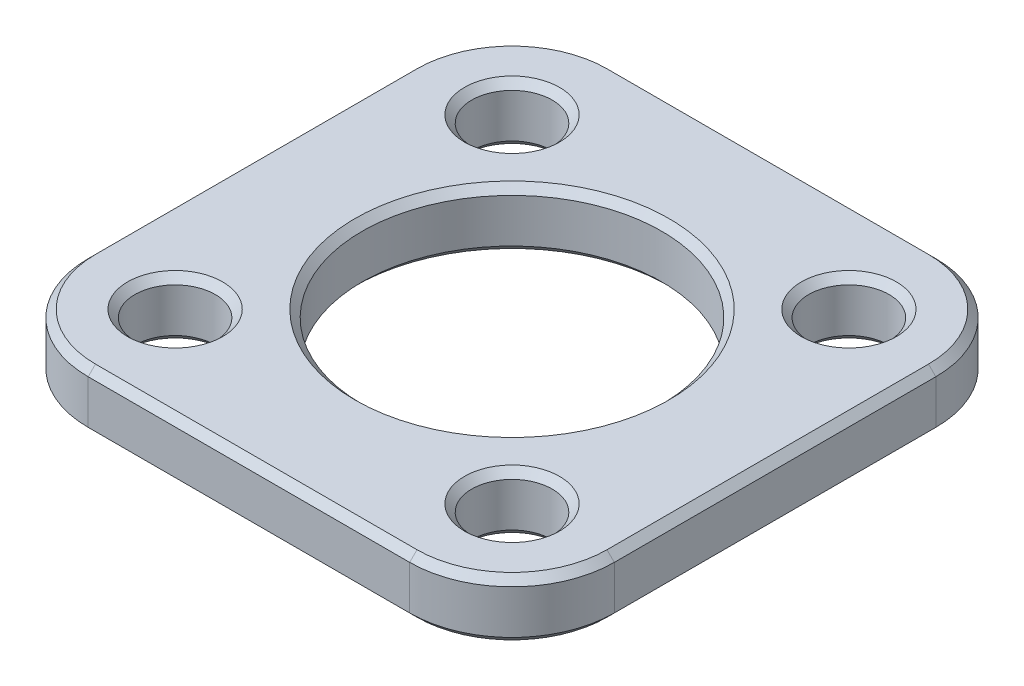
ISO-10303-21;
HEADER;
FILE_DESCRIPTION(('STEP AP214'),'2;1');
FILE_NAME('part.step','',(''),(''),'','','');
FILE_SCHEMA(('AUTOMOTIVE_DESIGN { 1 0 10303 214 1 1 1 1 }'));
ENDSEC;
DATA;
#1=APPLICATION_CONTEXT('core data for automotive mechanical design processes');
#2=APPLICATION_PROTOCOL_DEFINITION('international standard','automotive_design',2000,#1);
#3=PRODUCT_CONTEXT('',#1,'mechanical');
#4=PRODUCT('Part','Part','',(#3));
#5=PRODUCT_RELATED_PRODUCT_CATEGORY('part','',(#4));
#6=PRODUCT_DEFINITION_FORMATION('','',#4);
#7=PRODUCT_DEFINITION_CONTEXT('part definition',#1,'design');
#8=PRODUCT_DEFINITION('design','',#6,#7);
#9=PRODUCT_DEFINITION_SHAPE('','',#8);
#10=(LENGTH_UNIT() NAMED_UNIT(*) SI_UNIT(.MILLI.,.METRE.));
#11=(NAMED_UNIT(*) PLANE_ANGLE_UNIT() SI_UNIT($,.RADIAN.));
#12=(NAMED_UNIT(*) SI_UNIT($,.STERADIAN.) SOLID_ANGLE_UNIT());
#13=UNCERTAINTY_MEASURE_WITH_UNIT(LENGTH_MEASURE(1.E-05),#10,'distance_accuracy_value','');
#14=(GEOMETRIC_REPRESENTATION_CONTEXT(3) GLOBAL_UNCERTAINTY_ASSIGNED_CONTEXT((#13)) GLOBAL_UNIT_ASSIGNED_CONTEXT((#10,
#11,#12)) REPRESENTATION_CONTEXT('',''));
#15=CARTESIAN_POINT('',(0.,0.,0.));
#16=DIRECTION('',(0.,0.,1.));
#17=DIRECTION('',(1.,0.,0.));
#18=AXIS2_PLACEMENT_3D('',#15,#16,#17);
#19=CARTESIAN_POINT('',(-11.,4.,11.));
#20=DIRECTION('',(0.,1.,0.));
#21=DIRECTION('',(0.,0.,1.));
#22=AXIS2_PLACEMENT_3D('',#19,#20,#21);
#23=PLANE('',#22);
#24=CARTESIAN_POINT('',(-11.5258405333407,4.,11.5258405333407));
#25=DIRECTION('',(0.,1.,0.));
#26=DIRECTION('',(0.,0.,1.));
#27=AXIS2_PLACEMENT_3D('',#24,#25,#26);
#28=CIRCLE('',#27,3.25);
#29=CARTESIAN_POINT('',(-11.5258405333407,4.,14.7758405333407));
#30=VERTEX_POINT('',#29);
#31=EDGE_CURVE('E11',#30,#30,#28,.F.);
#32=ORIENTED_EDGE('',*,*,#31,.T.);
#33=EDGE_LOOP('',(#32));
#34=FACE_BOUND('',#33,.T.);
#35=CARTESIAN_POINT('',(11.5258405333407,4.,-11.5258405333407));
#36=DIRECTION('',(0.,1.,0.));
#37=DIRECTION('',(0.,0.,1.));
#38=AXIS2_PLACEMENT_3D('',#35,#36,#37);
#39=CIRCLE('',#38,3.25);
#40=CARTESIAN_POINT('',(11.5258405333407,4.,-8.27584053334073));
#41=VERTEX_POINT('',#40);
#42=EDGE_CURVE('E46',#41,#41,#39,.F.);
#43=ORIENTED_EDGE('',*,*,#42,.T.);
#44=EDGE_LOOP('',(#43));
#45=FACE_BOUND('',#44,.T.);
#46=CARTESIAN_POINT('',(0.,4.,0.));
#47=DIRECTION('',(0.,1.,0.));
#48=DIRECTION('',(0.,0.,1.));
#49=AXIS2_PLACEMENT_3D('',#46,#47,#48);
#50=CIRCLE('',#49,10.75);
#51=CARTESIAN_POINT('',(0.,4.,10.75));
#52=VERTEX_POINT('',#51);
#53=EDGE_CURVE('E281',#52,#52,#50,.F.);
#54=ORIENTED_EDGE('',*,*,#53,.T.);
#55=EDGE_LOOP('',(#54));
#56=FACE_BOUND('',#55,.T.);
#57=CARTESIAN_POINT('',(-11.,4.,-11.));
#58=DIRECTION('',(0.,1.,0.));
#59=DIRECTION('',(0.,0.,1.));
#60=AXIS2_PLACEMENT_3D('',#57,#58,#59);
#61=CIRCLE('',#60,6.50000000000001);
#62=CARTESIAN_POINT('',(-11.,4.,-17.5));
#63=VERTEX_POINT('',#62);
#64=CARTESIAN_POINT('',(-17.5,4.,-10.9999999999999));
#65=VERTEX_POINT('',#64);
#66=EDGE_CURVE('E54',#63,#65,#61,.T.);
#67=ORIENTED_EDGE('',*,*,#66,.T.);
#68=DIRECTION('',(0.,0.,1.));
#69=VECTOR('',#68,1.);
#70=CARTESIAN_POINT('',(-17.5,4.,10.9999999999999));
#71=LINE('',#70,#69);
#72=CARTESIAN_POINT('',(-17.5,4.,10.9999999999999));
#73=VERTEX_POINT('',#72);
#74=EDGE_CURVE('E279',#65,#73,#71,.T.);
#75=ORIENTED_EDGE('',*,*,#74,.T.);
#76=CARTESIAN_POINT('',(-11.,4.,11.));
#77=DIRECTION('',(0.,1.,0.));
#78=DIRECTION('',(0.,0.,1.));
#79=AXIS2_PLACEMENT_3D('',#76,#77,#78);
#80=CIRCLE('',#79,6.50000000000001);
#81=CARTESIAN_POINT('',(-10.9999999999999,4.,17.5));
#82=VERTEX_POINT('',#81);
#83=EDGE_CURVE('E267',#73,#82,#80,.T.);
#84=ORIENTED_EDGE('',*,*,#83,.T.);
#85=DIRECTION('',(1.,0.,0.));
#86=VECTOR('',#85,1.);
#87=CARTESIAN_POINT('',(11.,4.,17.5));
#88=LINE('',#87,#86);
#89=CARTESIAN_POINT('',(11.,4.,17.5));
#90=VERTEX_POINT('',#89);
#91=EDGE_CURVE('E269',#82,#90,#88,.T.);
#92=ORIENTED_EDGE('',*,*,#91,.T.);
#93=CARTESIAN_POINT('',(11.,4.,11.));
#94=DIRECTION('',(0.,1.,0.));
#95=DIRECTION('',(0.,0.,1.));
#96=AXIS2_PLACEMENT_3D('',#93,#94,#95);
#97=CIRCLE('',#96,6.50000000000001);
#98=CARTESIAN_POINT('',(17.5,4.,10.9999999999999));
#99=VERTEX_POINT('',#98);
#100=EDGE_CURVE('E271',#90,#99,#97,.T.);
#101=ORIENTED_EDGE('',*,*,#100,.T.);
#102=DIRECTION('',(0.,0.,-1.));
#103=VECTOR('',#102,1.);
#104=CARTESIAN_POINT('',(17.5,4.,-11.));
#105=LINE('',#104,#103);
#106=CARTESIAN_POINT('',(17.5,4.,-11.));
#107=VERTEX_POINT('',#106);
#108=EDGE_CURVE('E273',#99,#107,#105,.T.);
#109=ORIENTED_EDGE('',*,*,#108,.T.);
#110=CARTESIAN_POINT('',(11.,4.,-11.));
#111=DIRECTION('',(0.,1.,0.));
#112=DIRECTION('',(0.,0.,1.));
#113=AXIS2_PLACEMENT_3D('',#110,#111,#112);
#114=CIRCLE('',#113,6.50000000000001);
#115=CARTESIAN_POINT('',(11.,4.,-17.5));
#116=VERTEX_POINT('',#115);
#117=EDGE_CURVE('E275',#107,#116,#114,.T.);
#118=ORIENTED_EDGE('',*,*,#117,.T.);
#119=DIRECTION('',(-1.,0.,0.));
#120=VECTOR('',#119,1.);
#121=CARTESIAN_POINT('',(-10.9999999999999,4.,-17.5));
#122=LINE('',#121,#120);
#123=EDGE_CURVE('E59',#116,#63,#122,.T.);
#124=ORIENTED_EDGE('',*,*,#123,.T.);
#125=EDGE_LOOP('',(#67,#75,#84,#92,#101,#109,#118,#124));
#126=FACE_BOUND('',#125,.T.);
#127=CARTESIAN_POINT('',(-11.5258405333407,4.,-11.5258405333407));
#128=DIRECTION('',(0.,1.,0.));
#129=DIRECTION('',(0.,0.,1.));
#130=AXIS2_PLACEMENT_3D('',#127,#128,#129);
#131=CIRCLE('',#130,3.25);
#132=CARTESIAN_POINT('',(-11.5258405333407,4.,-8.27584053334073));
#133=VERTEX_POINT('',#132);
#134=EDGE_CURVE('E264',#133,#133,#131,.F.);
#135=ORIENTED_EDGE('',*,*,#134,.T.);
#136=EDGE_LOOP('',(#135));
#137=FACE_BOUND('',#136,.T.);
#138=CARTESIAN_POINT('',(11.5258405333407,4.,11.5258405333407));
#139=DIRECTION('',(0.,1.,0.));
#140=DIRECTION('',(0.,0.,1.));
#141=AXIS2_PLACEMENT_3D('',#138,#139,#140);
#142=CIRCLE('',#141,3.25);
#143=CARTESIAN_POINT('',(11.5258405333407,4.,14.7758405333407));
#144=VERTEX_POINT('',#143);
#145=EDGE_CURVE('E261',#144,#144,#142,.F.);
#146=ORIENTED_EDGE('',*,*,#145,.T.);
#147=EDGE_LOOP('',(#146));
#148=FACE_BOUND('',#147,.T.);
#149=ADVANCED_FACE('F36',(#34,#45,#56,#126,#137,#148),#23,.T.);
#150=CARTESIAN_POINT('',(-11.,0.,11.));
#151=DIRECTION('',(0.,1.,0.));
#152=DIRECTION('',(0.,0.,1.));
#153=AXIS2_PLACEMENT_3D('',#150,#151,#152);
#154=PLANE('',#153);
#155=CARTESIAN_POINT('',(-11.5258405333407,0.,11.5258405333407));
#156=DIRECTION('',(0.,1.,0.));
#157=DIRECTION('',(0.,0.,1.));
#158=AXIS2_PLACEMENT_3D('',#155,#156,#157);
#159=CIRCLE('',#158,3.24999999999999);
#160=CARTESIAN_POINT('',(-11.5258405333407,0.,14.7758405333407));
#161=VERTEX_POINT('',#160);
#162=EDGE_CURVE('E196',#161,#161,#159,.T.);
#163=ORIENTED_EDGE('',*,*,#162,.T.);
#164=EDGE_LOOP('',(#163));
#165=FACE_BOUND('',#164,.T.);
#166=CARTESIAN_POINT('',(11.5258405333407,0.,11.5258405333407));
#167=DIRECTION('',(0.,1.,0.));
#168=DIRECTION('',(0.,0.,1.));
#169=AXIS2_PLACEMENT_3D('',#166,#167,#168);
#170=CIRCLE('',#169,3.24999999999999);
#171=CARTESIAN_POINT('',(11.5258405333407,0.,14.7758405333407));
#172=VERTEX_POINT('',#171);
#173=EDGE_CURVE('E193',#172,#172,#170,.T.);
#174=ORIENTED_EDGE('',*,*,#173,.T.);
#175=EDGE_LOOP('',(#174));
#176=FACE_BOUND('',#175,.T.);
#177=CARTESIAN_POINT('',(11.5258405333407,0.,-11.5258405333407));
#178=DIRECTION('',(0.,1.,0.));
#179=DIRECTION('',(0.,0.,1.));
#180=AXIS2_PLACEMENT_3D('',#177,#178,#179);
#181=CIRCLE('',#180,3.25);
#182=CARTESIAN_POINT('',(11.5258405333407,0.,-8.27584053334073));
#183=VERTEX_POINT('',#182);
#184=EDGE_CURVE('E190',#183,#183,#181,.T.);
#185=ORIENTED_EDGE('',*,*,#184,.T.);
#186=EDGE_LOOP('',(#185));
#187=FACE_BOUND('',#186,.T.);
#188=CARTESIAN_POINT('',(-11.5258405333407,0.,-11.5258405333407));
#189=DIRECTION('',(0.,1.,0.));
#190=DIRECTION('',(0.,0.,1.));
#191=AXIS2_PLACEMENT_3D('',#188,#189,#190);
#192=CIRCLE('',#191,3.25);
#193=CARTESIAN_POINT('',(-11.5258405333407,0.,-8.27584053334073));
#194=VERTEX_POINT('',#193);
#195=EDGE_CURVE('E182',#194,#194,#192,.T.);
#196=ORIENTED_EDGE('',*,*,#195,.T.);
#197=EDGE_LOOP('',(#196));
#198=FACE_BOUND('',#197,.T.);
#199=CARTESIAN_POINT('',(0.,0.,0.));
#200=DIRECTION('',(0.,1.,0.));
#201=DIRECTION('',(0.,0.,1.));
#202=AXIS2_PLACEMENT_3D('',#199,#200,#201);
#203=CIRCLE('',#202,10.75);
#204=CARTESIAN_POINT('',(0.,0.,10.75));
#205=VERTEX_POINT('',#204);
#206=EDGE_CURVE('E179',#205,#205,#203,.T.);
#207=ORIENTED_EDGE('',*,*,#206,.T.);
#208=EDGE_LOOP('',(#207));
#209=FACE_BOUND('',#208,.T.);
#210=CARTESIAN_POINT('',(11.,0.,11.));
#211=DIRECTION('',(0.,1.,0.));
#212=DIRECTION('',(0.,0.,1.));
#213=AXIS2_PLACEMENT_3D('',#210,#211,#212);
#214=CIRCLE('',#213,6.5);
#215=CARTESIAN_POINT('',(17.5,0.,11.));
#216=VERTEX_POINT('',#215);
#217=CARTESIAN_POINT('',(11.,0.,17.5));
#218=VERTEX_POINT('',#217);
#219=EDGE_CURVE('E178',#216,#218,#214,.F.);
#220=ORIENTED_EDGE('',*,*,#219,.T.);
#221=DIRECTION('',(-1.,0.,0.));
#222=VECTOR('',#221,1.);
#223=CARTESIAN_POINT('',(-11.,0.,17.5));
#224=LINE('',#223,#222);
#225=CARTESIAN_POINT('',(-10.9999999999999,0.,17.5));
#226=VERTEX_POINT('',#225);
#227=EDGE_CURVE('E157',#218,#226,#224,.T.);
#228=ORIENTED_EDGE('',*,*,#227,.T.);
#229=CARTESIAN_POINT('',(-11.,0.,11.));
#230=DIRECTION('',(0.,1.,0.));
#231=DIRECTION('',(0.,0.,1.));
#232=AXIS2_PLACEMENT_3D('',#229,#230,#231);
#233=CIRCLE('',#232,6.5);
#234=CARTESIAN_POINT('',(-17.5,0.,10.9999999999999));
#235=VERTEX_POINT('',#234);
#236=EDGE_CURVE('E167',#226,#235,#233,.F.);
#237=ORIENTED_EDGE('',*,*,#236,.T.);
#238=DIRECTION('',(0.,0.,-1.));
#239=VECTOR('',#238,1.);
#240=CARTESIAN_POINT('',(-17.5,0.,11.));
#241=LINE('',#240,#239);
#242=CARTESIAN_POINT('',(-17.5,0.,-11.));
#243=VERTEX_POINT('',#242);
#244=EDGE_CURVE('E173',#235,#243,#241,.T.);
#245=ORIENTED_EDGE('',*,*,#244,.T.);
#246=CARTESIAN_POINT('',(-11.,0.,-11.));
#247=DIRECTION('',(0.,1.,0.));
#248=DIRECTION('',(0.,0.,1.));
#249=AXIS2_PLACEMENT_3D('',#246,#247,#248);
#250=CIRCLE('',#249,6.5);
#251=CARTESIAN_POINT('',(-10.9999999999999,0.,-17.5));
#252=VERTEX_POINT('',#251);
#253=EDGE_CURVE('E359',#243,#252,#250,.F.);
#254=ORIENTED_EDGE('',*,*,#253,.T.);
#255=DIRECTION('',(1.,0.,0.));
#256=VECTOR('',#255,1.);
#257=CARTESIAN_POINT('',(-11.,0.,-17.5));
#258=LINE('',#257,#256);
#259=CARTESIAN_POINT('',(11.,0.,-17.5));
#260=VERTEX_POINT('',#259);
#261=EDGE_CURVE('E361',#252,#260,#258,.T.);
#262=ORIENTED_EDGE('',*,*,#261,.T.);
#263=CARTESIAN_POINT('',(11.,0.,-11.));
#264=DIRECTION('',(0.,1.,0.));
#265=DIRECTION('',(0.,0.,1.));
#266=AXIS2_PLACEMENT_3D('',#263,#264,#265);
#267=CIRCLE('',#266,6.5);
#268=CARTESIAN_POINT('',(17.5,0.,-11.));
#269=VERTEX_POINT('',#268);
#270=EDGE_CURVE('E363',#260,#269,#267,.F.);
#271=ORIENTED_EDGE('',*,*,#270,.T.);
#272=DIRECTION('',(0.,0.,1.));
#273=VECTOR('',#272,1.);
#274=CARTESIAN_POINT('',(17.5,0.,11.));
#275=LINE('',#274,#273);
#276=EDGE_CURVE('E184',#269,#216,#275,.T.);
#277=ORIENTED_EDGE('',*,*,#276,.T.);
#278=EDGE_LOOP('',(#220,#228,#237,#245,#254,#262,#271,#277));
#279=FACE_BOUND('',#278,.T.);
#280=ADVANCED_FACE('F176',(#165,#176,#187,#198,#209,#279),#154,.F.);
#281=CARTESIAN_POINT('',(-11.,4.,11.));
#282=DIRECTION('',(0.,-1.,0.));
#283=DIRECTION('',(0.,0.,-1.));
#284=AXIS2_PLACEMENT_3D('',#281,#282,#283);
#285=CYLINDRICAL_SURFACE('',#284,7.);
#286=DIRECTION('',(0.,-1.,0.));
#287=VECTOR('',#286,1.);
#288=CARTESIAN_POINT('',(-18.,4.,10.9999999999999));
#289=LINE('',#288,#287);
#290=CARTESIAN_POINT('',(-18.,3.50000000000002,10.9999999999999));
#291=VERTEX_POINT('',#290);
#292=CARTESIAN_POINT('',(-18.,0.499999999999997,10.9999999999999));
#293=VERTEX_POINT('',#292);
#294=EDGE_CURVE('E302',#291,#293,#289,.T.);
#295=ORIENTED_EDGE('',*,*,#294,.T.);
#296=CARTESIAN_POINT('',(-11.,0.499999999999997,11.));
#297=DIRECTION('',(0.,1.,0.));
#298=DIRECTION('',(0.,0.,1.));
#299=AXIS2_PLACEMENT_3D('',#296,#297,#298);
#300=CIRCLE('',#299,7.);
#301=CARTESIAN_POINT('',(-10.9999999999999,0.499999999999997,18.));
#302=VERTEX_POINT('',#301);
#303=EDGE_CURVE('E259',#293,#302,#300,.T.);
#304=ORIENTED_EDGE('',*,*,#303,.T.);
#305=DIRECTION('',(0.,-1.,0.));
#306=VECTOR('',#305,1.);
#307=CARTESIAN_POINT('',(-10.9999999999999,4.,18.));
#308=LINE('',#307,#306);
#309=CARTESIAN_POINT('',(-10.9999999999999,3.50000000000002,18.));
#310=VERTEX_POINT('',#309);
#311=EDGE_CURVE('E174',#310,#302,#308,.T.);
#312=ORIENTED_EDGE('',*,*,#311,.F.);
#313=CARTESIAN_POINT('',(-11.,3.50000000000002,11.));
#314=DIRECTION('',(0.,1.,0.));
#315=DIRECTION('',(0.,0.,1.));
#316=AXIS2_PLACEMENT_3D('',#313,#314,#315);
#317=CIRCLE('',#316,7.);
#318=EDGE_CURVE('E257',#310,#291,#317,.F.);
#319=ORIENTED_EDGE('',*,*,#318,.T.);
#320=EDGE_LOOP('',(#295,#304,#312,#319));
#321=FACE_BOUND('',#320,.T.);
#322=ADVANCED_FACE('F380',(#321),#285,.T.);
#323=CARTESIAN_POINT('',(-10.9999999999999,4.,18.));
#324=DIRECTION('',(0.,0.,-1.));
#325=DIRECTION('',(-1.,0.,0.));
#326=AXIS2_PLACEMENT_3D('',#323,#324,#325);
#327=PLANE('',#326);
#328=ORIENTED_EDGE('',*,*,#311,.T.);
#329=DIRECTION('',(1.,0.,0.));
#330=VECTOR('',#329,1.);
#331=CARTESIAN_POINT('',(-10.9999999999999,0.499999999999997,18.));
#332=LINE('',#331,#330);
#333=CARTESIAN_POINT('',(11.,0.499999999999997,18.));
#334=VERTEX_POINT('',#333);
#335=EDGE_CURVE('E160',#302,#334,#332,.T.);
#336=ORIENTED_EDGE('',*,*,#335,.T.);
#337=DIRECTION('',(0.,-1.,0.));
#338=VECTOR('',#337,1.);
#339=CARTESIAN_POINT('',(11.,4.,18.));
#340=LINE('',#339,#338);
#341=CARTESIAN_POINT('',(11.,3.50000000000002,18.));
#342=VERTEX_POINT('',#341);
#343=EDGE_CURVE('E349',#342,#334,#340,.T.);
#344=ORIENTED_EDGE('',*,*,#343,.F.);
#345=DIRECTION('',(-1.,0.,0.));
#346=VECTOR('',#345,1.);
#347=CARTESIAN_POINT('',(-10.9999999999999,3.50000000000002,18.));
#348=LINE('',#347,#346);
#349=EDGE_CURVE('E229',#342,#310,#348,.T.);
#350=ORIENTED_EDGE('',*,*,#349,.T.);
#351=EDGE_LOOP('',(#328,#336,#344,#350));
#352=FACE_BOUND('',#351,.T.);
#353=ADVANCED_FACE('F373',(#352),#327,.F.);
#354=CARTESIAN_POINT('',(11.,4.,11.));
#355=DIRECTION('',(0.,-1.,0.));
#356=DIRECTION('',(0.,0.,-1.));
#357=AXIS2_PLACEMENT_3D('',#354,#355,#356);
#358=CYLINDRICAL_SURFACE('',#357,7.);
#359=ORIENTED_EDGE('',*,*,#343,.T.);
#360=CARTESIAN_POINT('',(11.,0.499999999999997,11.));
#361=DIRECTION('',(0.,1.,0.));
#362=DIRECTION('',(0.,0.,1.));
#363=AXIS2_PLACEMENT_3D('',#360,#361,#362);
#364=CIRCLE('',#363,7.);
#365=CARTESIAN_POINT('',(18.,0.499999999999997,10.9999999999999));
#366=VERTEX_POINT('',#365);
#367=EDGE_CURVE('E234',#334,#366,#364,.T.);
#368=ORIENTED_EDGE('',*,*,#367,.T.);
#369=DIRECTION('',(0.,-1.,0.));
#370=VECTOR('',#369,1.);
#371=CARTESIAN_POINT('',(18.,4.,10.9999999999999));
#372=LINE('',#371,#370);
#373=CARTESIAN_POINT('',(18.,3.50000000000002,10.9999999999999));
#374=VERTEX_POINT('',#373);
#375=EDGE_CURVE('E340',#374,#366,#372,.T.);
#376=ORIENTED_EDGE('',*,*,#375,.F.);
#377=CARTESIAN_POINT('',(11.,3.50000000000002,11.));
#378=DIRECTION('',(0.,1.,0.));
#379=DIRECTION('',(0.,0.,1.));
#380=AXIS2_PLACEMENT_3D('',#377,#378,#379);
#381=CIRCLE('',#380,7.);
#382=EDGE_CURVE('E232',#374,#342,#381,.F.);
#383=ORIENTED_EDGE('',*,*,#382,.T.);
#384=EDGE_LOOP('',(#359,#368,#376,#383));
#385=FACE_BOUND('',#384,.T.);
#386=ADVANCED_FACE('F346',(#385),#358,.T.);
#387=CARTESIAN_POINT('',(18.,4.,-11.));
#388=DIRECTION('',(-1.,0.,0.));
#389=DIRECTION('',(0.,0.,1.));
#390=AXIS2_PLACEMENT_3D('',#387,#388,#389);
#391=PLANE('',#390);
#392=ORIENTED_EDGE('',*,*,#375,.T.);
#393=DIRECTION('',(0.,0.,-1.));
#394=VECTOR('',#393,1.);
#395=CARTESIAN_POINT('',(18.,0.499999999999997,-11.));
#396=LINE('',#395,#394);
#397=CARTESIAN_POINT('',(18.,0.499999999999997,-11.));
#398=VERTEX_POINT('',#397);
#399=EDGE_CURVE('E238',#366,#398,#396,.T.);
#400=ORIENTED_EDGE('',*,*,#399,.T.);
#401=DIRECTION('',(0.,-1.,0.));
#402=VECTOR('',#401,1.);
#403=CARTESIAN_POINT('',(18.,4.,-11.));
#404=LINE('',#403,#402);
#405=CARTESIAN_POINT('',(18.,3.50000000000002,-11.));
#406=VERTEX_POINT('',#405);
#407=EDGE_CURVE('E343',#406,#398,#404,.T.);
#408=ORIENTED_EDGE('',*,*,#407,.F.);
#409=DIRECTION('',(0.,0.,1.));
#410=VECTOR('',#409,1.);
#411=CARTESIAN_POINT('',(18.,3.50000000000002,10.9999999999999));
#412=LINE('',#411,#410);
#413=EDGE_CURVE('E236',#406,#374,#412,.T.);
#414=ORIENTED_EDGE('',*,*,#413,.T.);
#415=EDGE_LOOP('',(#392,#400,#408,#414));
#416=FACE_BOUND('',#415,.T.);
#417=ADVANCED_FACE('F339',(#416),#391,.F.);
#418=CARTESIAN_POINT('',(11.,4.,-11.));
#419=DIRECTION('',(0.,-1.,0.));
#420=DIRECTION('',(0.,0.,-1.));
#421=AXIS2_PLACEMENT_3D('',#418,#419,#420);
#422=CYLINDRICAL_SURFACE('',#421,7.);
#423=ORIENTED_EDGE('',*,*,#407,.T.);
#424=CARTESIAN_POINT('',(11.,0.499999999999997,-11.));
#425=DIRECTION('',(0.,1.,0.));
#426=DIRECTION('',(0.,0.,1.));
#427=AXIS2_PLACEMENT_3D('',#424,#425,#426);
#428=CIRCLE('',#427,7.);
#429=CARTESIAN_POINT('',(11.,0.499999999999997,-18.));
#430=VERTEX_POINT('',#429);
#431=EDGE_CURVE('E242',#398,#430,#428,.T.);
#432=ORIENTED_EDGE('',*,*,#431,.T.);
#433=DIRECTION('',(0.,-1.,0.));
#434=VECTOR('',#433,1.);
#435=CARTESIAN_POINT('',(11.,4.,-18.));
#436=LINE('',#435,#434);
#437=CARTESIAN_POINT('',(11.,3.50000000000002,-18.));
#438=VERTEX_POINT('',#437);
#439=EDGE_CURVE('E352',#438,#430,#436,.T.);
#440=ORIENTED_EDGE('',*,*,#439,.F.);
#441=CARTESIAN_POINT('',(11.,3.50000000000002,-11.));
#442=DIRECTION('',(0.,1.,0.));
#443=DIRECTION('',(0.,0.,1.));
#444=AXIS2_PLACEMENT_3D('',#441,#442,#443);
#445=CIRCLE('',#444,7.);
#446=EDGE_CURVE('E240',#438,#406,#445,.F.);
#447=ORIENTED_EDGE('',*,*,#446,.T.);
#448=EDGE_LOOP('',(#423,#432,#440,#447));
#449=FACE_BOUND('',#448,.T.);
#450=ADVANCED_FACE('F425',(#449),#422,.T.);
#451=CARTESIAN_POINT('',(-10.9999999999999,4.,-18.));
#452=DIRECTION('',(0.,0.,1.));
#453=DIRECTION('',(1.,0.,0.));
#454=AXIS2_PLACEMENT_3D('',#451,#452,#453);
#455=PLANE('',#454);
#456=ORIENTED_EDGE('',*,*,#439,.T.);
#457=DIRECTION('',(-1.,0.,0.));
#458=VECTOR('',#457,1.);
#459=CARTESIAN_POINT('',(-10.9999999999999,0.499999999999997,-18.));
#460=LINE('',#459,#458);
#461=CARTESIAN_POINT('',(-10.9999999999999,0.499999999999997,-18.));
#462=VERTEX_POINT('',#461);
#463=EDGE_CURVE('E246',#430,#462,#460,.T.);
#464=ORIENTED_EDGE('',*,*,#463,.T.);
#465=DIRECTION('',(0.,-1.,0.));
#466=VECTOR('',#465,1.);
#467=CARTESIAN_POINT('',(-10.9999999999999,4.,-18.));
#468=LINE('',#467,#466);
#469=CARTESIAN_POINT('',(-10.9999999999999,3.50000000000002,-18.));
#470=VERTEX_POINT('',#469);
#471=EDGE_CURVE('E406',#470,#462,#468,.T.);
#472=ORIENTED_EDGE('',*,*,#471,.F.);
#473=DIRECTION('',(1.,0.,0.));
#474=VECTOR('',#473,1.);
#475=CARTESIAN_POINT('',(11.,3.50000000000002,-18.));
#476=LINE('',#475,#474);
#477=EDGE_CURVE('E244',#470,#438,#476,.T.);
#478=ORIENTED_EDGE('',*,*,#477,.T.);
#479=EDGE_LOOP('',(#456,#464,#472,#478));
#480=FACE_BOUND('',#479,.T.);
#481=ADVANCED_FACE('F414',(#480),#455,.F.);
#482=CARTESIAN_POINT('',(-11.,4.,-11.));
#483=DIRECTION('',(0.,-1.,0.));
#484=DIRECTION('',(0.,0.,-1.));
#485=AXIS2_PLACEMENT_3D('',#482,#483,#484);
#486=CYLINDRICAL_SURFACE('',#485,7.);
#487=ORIENTED_EDGE('',*,*,#471,.T.);
#488=CARTESIAN_POINT('',(-11.,0.499999999999997,-11.));
#489=DIRECTION('',(0.,1.,0.));
#490=DIRECTION('',(0.,0.,1.));
#491=AXIS2_PLACEMENT_3D('',#488,#489,#490);
#492=CIRCLE('',#491,7.);
#493=CARTESIAN_POINT('',(-18.,0.499999999999997,-10.9999999999999));
#494=VERTEX_POINT('',#493);
#495=EDGE_CURVE('E250',#462,#494,#492,.T.);
#496=ORIENTED_EDGE('',*,*,#495,.T.);
#497=DIRECTION('',(0.,-1.,0.));
#498=VECTOR('',#497,1.);
#499=CARTESIAN_POINT('',(-18.,4.,-10.9999999999999));
#500=LINE('',#499,#498);
#501=CARTESIAN_POINT('',(-18.,3.50000000000002,-10.9999999999999));
#502=VERTEX_POINT('',#501);
#503=EDGE_CURVE('E399',#502,#494,#500,.T.);
#504=ORIENTED_EDGE('',*,*,#503,.F.);
#505=CARTESIAN_POINT('',(-11.,3.50000000000002,-11.));
#506=DIRECTION('',(0.,1.,0.));
#507=DIRECTION('',(0.,0.,1.));
#508=AXIS2_PLACEMENT_3D('',#505,#506,#507);
#509=CIRCLE('',#508,7.);
#510=EDGE_CURVE('E248',#502,#470,#509,.F.);
#511=ORIENTED_EDGE('',*,*,#510,.T.);
#512=EDGE_LOOP('',(#487,#496,#504,#511));
#513=FACE_BOUND('',#512,.T.);
#514=ADVANCED_FACE('F403',(#513),#486,.T.);
#515=CARTESIAN_POINT('',(-18.,4.,-10.9999999999999));
#516=DIRECTION('',(1.,0.,0.));
#517=DIRECTION('',(0.,0.,-1.));
#518=AXIS2_PLACEMENT_3D('',#515,#516,#517);
#519=PLANE('',#518);
#520=ORIENTED_EDGE('',*,*,#503,.T.);
#521=DIRECTION('',(0.,0.,1.));
#522=VECTOR('',#521,1.);
#523=CARTESIAN_POINT('',(-18.,0.499999999999997,-10.9999999999999));
#524=LINE('',#523,#522);
#525=EDGE_CURVE('E255',#494,#293,#524,.T.);
#526=ORIENTED_EDGE('',*,*,#525,.T.);
#527=ORIENTED_EDGE('',*,*,#294,.F.);
#528=DIRECTION('',(0.,0.,-1.));
#529=VECTOR('',#528,1.);
#530=CARTESIAN_POINT('',(-18.,3.50000000000002,-10.9999999999999));
#531=LINE('',#530,#529);
#532=EDGE_CURVE('E252',#291,#502,#531,.T.);
#533=ORIENTED_EDGE('',*,*,#532,.T.);
#534=EDGE_LOOP('',(#520,#526,#527,#533));
#535=FACE_BOUND('',#534,.T.);
#536=ADVANCED_FACE('F398',(#535),#519,.F.);
#537=CARTESIAN_POINT('',(0.,4.,0.));
#538=DIRECTION('',(0.,-1.,0.));
#539=DIRECTION('',(0.,0.,-1.));
#540=AXIS2_PLACEMENT_3D('',#537,#538,#539);
#541=CYLINDRICAL_SURFACE('',#540,10.25);
#542=CARTESIAN_POINT('',(0.,0.499999999999997,0.));
#543=DIRECTION('',(0.,1.,0.));
#544=DIRECTION('',(0.,0.,1.));
#545=AXIS2_PLACEMENT_3D('',#542,#543,#544);
#546=CIRCLE('',#545,10.25);
#547=CARTESIAN_POINT('',(0.,0.499999999999997,10.25));
#548=VERTEX_POINT('',#547);
#549=EDGE_CURVE('E226',#548,#548,#546,.F.);
#550=ORIENTED_EDGE('',*,*,#549,.T.);
#551=EDGE_LOOP('',(#550));
#552=FACE_BOUND('',#551,.T.);
#553=CARTESIAN_POINT('',(0.,3.49999999999999,0.));
#554=DIRECTION('',(0.,1.,0.));
#555=DIRECTION('',(0.,0.,1.));
#556=AXIS2_PLACEMENT_3D('',#553,#554,#555);
#557=CIRCLE('',#556,10.25);
#558=CARTESIAN_POINT('',(0.,3.49999999999999,10.25));
#559=VERTEX_POINT('',#558);
#560=EDGE_CURVE('E223',#559,#559,#557,.T.);
#561=ORIENTED_EDGE('',*,*,#560,.T.);
#562=EDGE_LOOP('',(#561));
#563=FACE_BOUND('',#562,.T.);
#564=ADVANCED_FACE('F444',(#552,#563),#541,.F.);
#565=CARTESIAN_POINT('',(-11.5258405333407,4.,-11.5258405333407));
#566=DIRECTION('',(0.,-1.,0.));
#567=DIRECTION('',(0.,0.,-1.));
#568=AXIS2_PLACEMENT_3D('',#565,#566,#567);
#569=CYLINDRICAL_SURFACE('',#568,2.75);
#570=CARTESIAN_POINT('',(-11.5258405333407,0.500000000000002,-11.5258405333407));
#571=DIRECTION('',(0.,1.,0.));
#572=DIRECTION('',(0.,0.,1.));
#573=AXIS2_PLACEMENT_3D('',#570,#571,#572);
#574=CIRCLE('',#573,2.75);
#575=CARTESIAN_POINT('',(-11.5258405333407,0.500000000000002,-8.77584053334073));
#576=VERTEX_POINT('',#575);
#577=EDGE_CURVE('E220',#576,#576,#574,.F.);
#578=ORIENTED_EDGE('',*,*,#577,.T.);
#579=EDGE_LOOP('',(#578));
#580=FACE_BOUND('',#579,.T.);
#581=CARTESIAN_POINT('',(-11.5258405333407,3.49999999999999,-11.5258405333407));
#582=DIRECTION('',(0.,1.,0.));
#583=DIRECTION('',(0.,0.,1.));
#584=AXIS2_PLACEMENT_3D('',#581,#582,#583);
#585=CIRCLE('',#584,2.75);
#586=CARTESIAN_POINT('',(-11.5258405333407,3.49999999999999,-8.77584053334073));
#587=VERTEX_POINT('',#586);
#588=EDGE_CURVE('E217',#587,#587,#585,.T.);
#589=ORIENTED_EDGE('',*,*,#588,.T.);
#590=EDGE_LOOP('',(#589));
#591=FACE_BOUND('',#590,.T.);
#592=ADVANCED_FACE('F464',(#580,#591),#569,.F.);
#593=CARTESIAN_POINT('',(11.5258405333407,4.,-11.5258405333407));
#594=DIRECTION('',(0.,-1.,0.));
#595=DIRECTION('',(0.,0.,-1.));
#596=AXIS2_PLACEMENT_3D('',#593,#594,#595);
#597=CYLINDRICAL_SURFACE('',#596,2.75);
#598=CARTESIAN_POINT('',(11.5258405333407,0.500000000000002,-11.5258405333407));
#599=DIRECTION('',(0.,1.,0.));
#600=DIRECTION('',(0.,0.,1.));
#601=AXIS2_PLACEMENT_3D('',#598,#599,#600);
#602=CIRCLE('',#601,2.75);
#603=CARTESIAN_POINT('',(11.5258405333407,0.500000000000002,-8.77584053334073));
#604=VERTEX_POINT('',#603);
#605=EDGE_CURVE('E214',#604,#604,#602,.F.);
#606=ORIENTED_EDGE('',*,*,#605,.T.);
#607=EDGE_LOOP('',(#606));
#608=FACE_BOUND('',#607,.T.);
#609=CARTESIAN_POINT('',(11.5258405333407,3.49999999999999,-11.5258405333407));
#610=DIRECTION('',(0.,1.,0.));
#611=DIRECTION('',(0.,0.,1.));
#612=AXIS2_PLACEMENT_3D('',#609,#610,#611);
#613=CIRCLE('',#612,2.75);
#614=CARTESIAN_POINT('',(11.5258405333407,3.49999999999999,-8.77584053334073));
#615=VERTEX_POINT('',#614);
#616=EDGE_CURVE('E211',#615,#615,#613,.T.);
#617=ORIENTED_EDGE('',*,*,#616,.T.);
#618=EDGE_LOOP('',(#617));
#619=FACE_BOUND('',#618,.T.);
#620=ADVANCED_FACE('F471',(#608,#619),#597,.F.);
#621=CARTESIAN_POINT('',(11.5258405333407,4.,11.5258405333407));
#622=DIRECTION('',(0.,-1.,0.));
#623=DIRECTION('',(0.,0.,-1.));
#624=AXIS2_PLACEMENT_3D('',#621,#622,#623);
#625=CYLINDRICAL_SURFACE('',#624,2.75);
#626=CARTESIAN_POINT('',(11.5258405333407,0.499999999999995,11.5258405333407));
#627=DIRECTION('',(0.,1.,0.));
#628=DIRECTION('',(0.,0.,1.));
#629=AXIS2_PLACEMENT_3D('',#626,#627,#628);
#630=CIRCLE('',#629,2.75);
#631=CARTESIAN_POINT('',(11.5258405333407,0.499999999999995,14.2758405333407));
#632=VERTEX_POINT('',#631);
#633=EDGE_CURVE('E208',#632,#632,#630,.F.);
#634=ORIENTED_EDGE('',*,*,#633,.T.);
#635=EDGE_LOOP('',(#634));
#636=FACE_BOUND('',#635,.T.);
#637=CARTESIAN_POINT('',(11.5258405333407,3.49999999999999,11.5258405333407));
#638=DIRECTION('',(0.,1.,0.));
#639=DIRECTION('',(0.,0.,1.));
#640=AXIS2_PLACEMENT_3D('',#637,#638,#639);
#641=CIRCLE('',#640,2.75);
#642=CARTESIAN_POINT('',(11.5258405333407,3.49999999999999,14.2758405333407));
#643=VERTEX_POINT('',#642);
#644=EDGE_CURVE('E205',#643,#643,#641,.T.);
#645=ORIENTED_EDGE('',*,*,#644,.T.);
#646=EDGE_LOOP('',(#645));
#647=FACE_BOUND('',#646,.T.);
#648=ADVANCED_FACE('F478',(#636,#647),#625,.F.);
#649=CARTESIAN_POINT('',(-11.5258405333407,4.,11.5258405333407));
#650=DIRECTION('',(0.,-1.,0.));
#651=DIRECTION('',(0.,0.,-1.));
#652=AXIS2_PLACEMENT_3D('',#649,#650,#651);
#653=CYLINDRICAL_SURFACE('',#652,2.75);
#654=CARTESIAN_POINT('',(-11.5258405333407,0.499999999999994,11.5258405333407));
#655=DIRECTION('',(0.,1.,0.));
#656=DIRECTION('',(0.,0.,1.));
#657=AXIS2_PLACEMENT_3D('',#654,#655,#656);
#658=CIRCLE('',#657,2.75);
#659=CARTESIAN_POINT('',(-11.5258405333407,0.499999999999994,14.2758405333407));
#660=VERTEX_POINT('',#659);
#661=EDGE_CURVE('E202',#660,#660,#658,.F.);
#662=ORIENTED_EDGE('',*,*,#661,.T.);
#663=EDGE_LOOP('',(#662));
#664=FACE_BOUND('',#663,.T.);
#665=CARTESIAN_POINT('',(-11.5258405333407,3.49999999999999,11.5258405333407));
#666=DIRECTION('',(0.,1.,0.));
#667=DIRECTION('',(0.,0.,1.));
#668=AXIS2_PLACEMENT_3D('',#665,#666,#667);
#669=CIRCLE('',#668,2.75);
#670=CARTESIAN_POINT('',(-11.5258405333407,3.49999999999999,14.2758405333407));
#671=VERTEX_POINT('',#670);
#672=EDGE_CURVE('E199',#671,#671,#669,.T.);
#673=ORIENTED_EDGE('',*,*,#672,.T.);
#674=EDGE_LOOP('',(#673));
#675=FACE_BOUND('',#674,.T.);
#676=ADVANCED_FACE('F486',(#664,#675),#653,.F.);
#677=CARTESIAN_POINT('',(-11.5258405333407,0.,11.5258405333407));
#678=DIRECTION('',(0.,-1.,0.));
#679=DIRECTION('',(0.,0.,-1.));
#680=AXIS2_PLACEMENT_3D('',#677,#678,#679);
#681=CONICAL_SURFACE('',#680,3.24999999999999,0.785398163397444);
#682=ORIENTED_EDGE('',*,*,#661,.F.);
#683=EDGE_LOOP('',(#682));
#684=FACE_BOUND('',#683,.T.);
#685=ORIENTED_EDGE('',*,*,#162,.F.);
#686=EDGE_LOOP('',(#685));
#687=FACE_BOUND('',#686,.T.);
#688=ADVANCED_FACE('F494',(#684,#687),#681,.F.);
#689=CARTESIAN_POINT('',(11.5258405333407,0.,11.5258405333407));
#690=DIRECTION('',(0.,-1.,0.));
#691=DIRECTION('',(0.,0.,-1.));
#692=AXIS2_PLACEMENT_3D('',#689,#690,#691);
#693=CONICAL_SURFACE('',#692,3.24999999999999,0.785398163397444);
#694=ORIENTED_EDGE('',*,*,#633,.F.);
#695=EDGE_LOOP('',(#694));
#696=FACE_BOUND('',#695,.T.);
#697=ORIENTED_EDGE('',*,*,#173,.F.);
#698=EDGE_LOOP('',(#697));
#699=FACE_BOUND('',#698,.T.);
#700=ADVANCED_FACE('F502',(#696,#699),#693,.F.);
#701=CARTESIAN_POINT('',(11.5258405333407,0.,-11.5258405333407));
#702=DIRECTION('',(0.,-1.,0.));
#703=DIRECTION('',(0.,0.,-1.));
#704=AXIS2_PLACEMENT_3D('',#701,#702,#703);
#705=CONICAL_SURFACE('',#704,3.25,0.785398163397451);
#706=ORIENTED_EDGE('',*,*,#605,.F.);
#707=EDGE_LOOP('',(#706));
#708=FACE_BOUND('',#707,.T.);
#709=ORIENTED_EDGE('',*,*,#184,.F.);
#710=EDGE_LOOP('',(#709));
#711=FACE_BOUND('',#710,.T.);
#712=ADVANCED_FACE('F510',(#708,#711),#705,.F.);
#713=CARTESIAN_POINT('',(-11.5258405333407,0.,-11.5258405333407));
#714=DIRECTION('',(0.,-1.,0.));
#715=DIRECTION('',(0.,0.,-1.));
#716=AXIS2_PLACEMENT_3D('',#713,#714,#715);
#717=CONICAL_SURFACE('',#716,3.25,0.785398163397451);
#718=ORIENTED_EDGE('',*,*,#577,.F.);
#719=EDGE_LOOP('',(#718));
#720=FACE_BOUND('',#719,.T.);
#721=ORIENTED_EDGE('',*,*,#195,.F.);
#722=EDGE_LOOP('',(#721));
#723=FACE_BOUND('',#722,.T.);
#724=ADVANCED_FACE('F518',(#720,#723),#717,.F.);
#725=CARTESIAN_POINT('',(0.,0.,0.));
#726=DIRECTION('',(0.,-1.,0.));
#727=DIRECTION('',(0.,0.,-1.));
#728=AXIS2_PLACEMENT_3D('',#725,#726,#727);
#729=CONICAL_SURFACE('',#728,10.75,0.785398163397447);
#730=ORIENTED_EDGE('',*,*,#549,.F.);
#731=EDGE_LOOP('',(#730));
#732=FACE_BOUND('',#731,.T.);
#733=ORIENTED_EDGE('',*,*,#206,.F.);
#734=EDGE_LOOP('',(#733));
#735=FACE_BOUND('',#734,.T.);
#736=ADVANCED_FACE('F526',(#732,#735),#729,.F.);
#737=CARTESIAN_POINT('',(-10.9999999999999,0.499999999999997,-18.));
#738=DIRECTION('',(0.,0.70710678118655,0.707106781186545));
#739=DIRECTION('',(-1.,0.,0.));
#740=AXIS2_PLACEMENT_3D('',#737,#738,#739);
#741=PLANE('',#740);
#742=DIRECTION('',(0.,0.707106781186545,-0.70710678118655));
#743=VECTOR('',#742,1.);
#744=CARTESIAN_POINT('',(11.,0.,-17.5));
#745=LINE('',#744,#743);
#746=EDGE_CURVE('E296',#260,#430,#745,.T.);
#747=ORIENTED_EDGE('',*,*,#746,.F.);
#748=ORIENTED_EDGE('',*,*,#261,.F.);
#749=DIRECTION('',(0.,-0.707106781186545,0.70710678118655));
#750=VECTOR('',#749,1.);
#751=CARTESIAN_POINT('',(-10.9999999999999,0.499999999999997,-18.));
#752=LINE('',#751,#750);
#753=EDGE_CURVE('E299',#462,#252,#752,.T.);
#754=ORIENTED_EDGE('',*,*,#753,.F.);
#755=ORIENTED_EDGE('',*,*,#463,.F.);
#756=EDGE_LOOP('',(#747,#748,#754,#755));
#757=FACE_BOUND('',#756,.T.);
#758=ADVANCED_FACE('F420',(#757),#741,.F.);
#759=CARTESIAN_POINT('',(-11.,0.499999999999997,-11.));
#760=DIRECTION('',(0.,1.,0.));
#761=DIRECTION('',(0.,0.,1.));
#762=AXIS2_PLACEMENT_3D('',#759,#760,#761);
#763=CONICAL_SURFACE('',#762,7.,0.785398163397452);
#764=ORIENTED_EDGE('',*,*,#753,.T.);
#765=ORIENTED_EDGE('',*,*,#253,.F.);
#766=DIRECTION('',(0.70710678118655,-0.707106781186545,0.));
#767=VECTOR('',#766,1.);
#768=CARTESIAN_POINT('',(-18.,0.499999999999997,-10.9999999999999));
#769=LINE('',#768,#767);
#770=EDGE_CURVE('E293',#494,#243,#769,.T.);
#771=ORIENTED_EDGE('',*,*,#770,.F.);
#772=ORIENTED_EDGE('',*,*,#495,.F.);
#773=EDGE_LOOP('',(#764,#765,#771,#772));
#774=FACE_BOUND('',#773,.T.);
#775=ADVANCED_FACE('F541',(#774),#763,.T.);
#776=CARTESIAN_POINT('',(11.,0.499999999999997,-11.));
#777=DIRECTION('',(0.,1.,0.));
#778=DIRECTION('',(0.,0.,1.));
#779=AXIS2_PLACEMENT_3D('',#776,#777,#778);
#780=CONICAL_SURFACE('',#779,7.,0.785398163397452);
#781=ORIENTED_EDGE('',*,*,#746,.T.);
#782=ORIENTED_EDGE('',*,*,#431,.F.);
#783=DIRECTION('',(0.70710678118655,0.707106781186545,0.));
#784=VECTOR('',#783,1.);
#785=CARTESIAN_POINT('',(17.5,0.,-11.));
#786=LINE('',#785,#784);
#787=EDGE_CURVE('E290',#269,#398,#786,.T.);
#788=ORIENTED_EDGE('',*,*,#787,.F.);
#789=ORIENTED_EDGE('',*,*,#270,.F.);
#790=EDGE_LOOP('',(#781,#782,#788,#789));
#791=FACE_BOUND('',#790,.T.);
#792=ADVANCED_FACE('F424',(#791),#780,.T.);
#793=CARTESIAN_POINT('',(-18.,0.499999999999997,-10.9999999999999));
#794=DIRECTION('',(0.707106781186545,0.70710678118655,0.));
#795=DIRECTION('',(0.,0.,1.));
#796=AXIS2_PLACEMENT_3D('',#793,#794,#795);
#797=PLANE('',#796);
#798=ORIENTED_EDGE('',*,*,#770,.T.);
#799=ORIENTED_EDGE('',*,*,#244,.F.);
#800=DIRECTION('',(0.70710678118655,-0.707106781186545,0.));
#801=VECTOR('',#800,1.);
#802=CARTESIAN_POINT('',(-18.,0.499999999999997,10.9999999999999));
#803=LINE('',#802,#801);
#804=EDGE_CURVE('E170',#293,#235,#803,.T.);
#805=ORIENTED_EDGE('',*,*,#804,.F.);
#806=ORIENTED_EDGE('',*,*,#525,.F.);
#807=EDGE_LOOP('',(#798,#799,#805,#806));
#808=FACE_BOUND('',#807,.T.);
#809=ADVANCED_FACE('F555',(#808),#797,.F.);
#810=CARTESIAN_POINT('',(18.,0.499999999999997,-11.));
#811=DIRECTION('',(-0.707106781186545,0.70710678118655,0.));
#812=DIRECTION('',(0.,0.,-1.));
#813=AXIS2_PLACEMENT_3D('',#810,#811,#812);
#814=PLANE('',#813);
#815=ORIENTED_EDGE('',*,*,#787,.T.);
#816=ORIENTED_EDGE('',*,*,#399,.F.);
#817=DIRECTION('',(0.70710678118655,0.707106781186545,0.));
#818=VECTOR('',#817,1.);
#819=CARTESIAN_POINT('',(17.5,0.,11.));
#820=LINE('',#819,#818);
#821=EDGE_CURVE('E163',#216,#366,#820,.T.);
#822=ORIENTED_EDGE('',*,*,#821,.F.);
#823=ORIENTED_EDGE('',*,*,#276,.F.);
#824=EDGE_LOOP('',(#815,#816,#822,#823));
#825=FACE_BOUND('',#824,.T.);
#826=ADVANCED_FACE('F369',(#825),#814,.F.);
#827=CARTESIAN_POINT('',(-11.,0.499999999999997,11.));
#828=DIRECTION('',(0.,1.,0.));
#829=DIRECTION('',(0.,0.,1.));
#830=AXIS2_PLACEMENT_3D('',#827,#828,#829);
#831=CONICAL_SURFACE('',#830,7.,0.785398163397452);
#832=ORIENTED_EDGE('',*,*,#804,.T.);
#833=ORIENTED_EDGE('',*,*,#236,.F.);
#834=DIRECTION('',(0.,-0.707106781186545,-0.70710678118655));
#835=VECTOR('',#834,1.);
#836=CARTESIAN_POINT('',(-10.9999999999999,0.499999999999997,18.));
#837=LINE('',#836,#835);
#838=EDGE_CURVE('E153',#302,#226,#837,.T.);
#839=ORIENTED_EDGE('',*,*,#838,.F.);
#840=ORIENTED_EDGE('',*,*,#303,.F.);
#841=EDGE_LOOP('',(#832,#833,#839,#840));
#842=FACE_BOUND('',#841,.T.);
#843=ADVANCED_FACE('F168',(#842),#831,.T.);
#844=CARTESIAN_POINT('',(11.,0.499999999999997,11.));
#845=DIRECTION('',(0.,1.,0.));
#846=DIRECTION('',(0.,0.,1.));
#847=AXIS2_PLACEMENT_3D('',#844,#845,#846);
#848=CONICAL_SURFACE('',#847,7.,0.785398163397452);
#849=ORIENTED_EDGE('',*,*,#821,.T.);
#850=ORIENTED_EDGE('',*,*,#367,.F.);
#851=DIRECTION('',(0.,0.707106781186545,0.70710678118655));
#852=VECTOR('',#851,1.);
#853=CARTESIAN_POINT('',(11.,0.,17.5));
#854=LINE('',#853,#852);
#855=EDGE_CURVE('E164',#218,#334,#854,.T.);
#856=ORIENTED_EDGE('',*,*,#855,.F.);
#857=ORIENTED_EDGE('',*,*,#219,.F.);
#858=EDGE_LOOP('',(#849,#850,#856,#857));
#859=FACE_BOUND('',#858,.T.);
#860=ADVANCED_FACE('F371',(#859),#848,.T.);
#861=CARTESIAN_POINT('',(-10.9999999999999,0.499999999999997,18.));
#862=DIRECTION('',(0.,0.70710678118655,-0.707106781186545));
#863=DIRECTION('',(1.,0.,0.));
#864=AXIS2_PLACEMENT_3D('',#861,#862,#863);
#865=PLANE('',#864);
#866=ORIENTED_EDGE('',*,*,#838,.T.);
#867=ORIENTED_EDGE('',*,*,#227,.F.);
#868=ORIENTED_EDGE('',*,*,#855,.T.);
#869=ORIENTED_EDGE('',*,*,#335,.F.);
#870=EDGE_LOOP('',(#866,#867,#868,#869));
#871=FACE_BOUND('',#870,.T.);
#872=ADVANCED_FACE('F155',(#871),#865,.F.);
#873=CARTESIAN_POINT('',(-11.5258405333407,3.49999999999999,11.5258405333407));
#874=DIRECTION('',(0.,1.,0.));
#875=DIRECTION('',(0.,0.,1.));
#876=AXIS2_PLACEMENT_3D('',#873,#874,#875);
#877=CONICAL_SURFACE('',#876,2.75,0.785398163397446);
#878=ORIENTED_EDGE('',*,*,#31,.F.);
#879=EDGE_LOOP('',(#878));
#880=FACE_BOUND('',#879,.T.);
#881=ORIENTED_EDGE('',*,*,#672,.F.);
#882=EDGE_LOOP('',(#881));
#883=FACE_BOUND('',#882,.T.);
#884=ADVANCED_FACE('F587',(#880,#883),#877,.F.);
#885=CARTESIAN_POINT('',(11.5258405333407,3.49999999999999,-11.5258405333407));
#886=DIRECTION('',(0.,1.,0.));
#887=DIRECTION('',(0.,0.,1.));
#888=AXIS2_PLACEMENT_3D('',#885,#886,#887);
#889=CONICAL_SURFACE('',#888,2.75,0.785398163397446);
#890=ORIENTED_EDGE('',*,*,#42,.F.);
#891=EDGE_LOOP('',(#890));
#892=FACE_BOUND('',#891,.T.);
#893=ORIENTED_EDGE('',*,*,#616,.F.);
#894=EDGE_LOOP('',(#893));
#895=FACE_BOUND('',#894,.T.);
#896=ADVANCED_FACE('F594',(#892,#895),#889,.F.);
#897=CARTESIAN_POINT('',(0.,3.49999999999999,0.));
#898=DIRECTION('',(0.,1.,0.));
#899=DIRECTION('',(0.,0.,1.));
#900=AXIS2_PLACEMENT_3D('',#897,#898,#899);
#901=CONICAL_SURFACE('',#900,10.25,0.785398163397448);
#902=ORIENTED_EDGE('',*,*,#53,.F.);
#903=EDGE_LOOP('',(#902));
#904=FACE_BOUND('',#903,.T.);
#905=ORIENTED_EDGE('',*,*,#560,.F.);
#906=EDGE_LOOP('',(#905));
#907=FACE_BOUND('',#906,.T.);
#908=ADVANCED_FACE('F602',(#904,#907),#901,.F.);
#909=CARTESIAN_POINT('',(17.5,4.,11.));
#910=DIRECTION('',(0.707106781186545,0.70710678118655,0.));
#911=DIRECTION('',(0.,0.,1.));
#912=AXIS2_PLACEMENT_3D('',#909,#910,#911);
#913=PLANE('',#912);
#914=DIRECTION('',(-0.70710678118655,0.707106781186545,0.));
#915=VECTOR('',#914,1.);
#916=CARTESIAN_POINT('',(18.,3.50000000000002,10.9999999999999));
#917=LINE('',#916,#915);
#918=EDGE_CURVE('E318',#374,#99,#917,.T.);
#919=ORIENTED_EDGE('',*,*,#918,.F.);
#920=ORIENTED_EDGE('',*,*,#413,.F.);
#921=DIRECTION('',(0.70710678118655,-0.707106781186545,0.));
#922=VECTOR('',#921,1.);
#923=CARTESIAN_POINT('',(17.5,4.,-11.));
#924=LINE('',#923,#922);
#925=EDGE_CURVE('E41',#107,#406,#924,.T.);
#926=ORIENTED_EDGE('',*,*,#925,.F.);
#927=ORIENTED_EDGE('',*,*,#108,.F.);
#928=EDGE_LOOP('',(#919,#920,#926,#927));
#929=FACE_BOUND('',#928,.T.);
#930=ADVANCED_FACE('F334',(#929),#913,.T.);
#931=CARTESIAN_POINT('',(11.,4.,-11.));
#932=DIRECTION('',(0.,-1.,0.));
#933=DIRECTION('',(0.,0.,-1.));
#934=AXIS2_PLACEMENT_3D('',#931,#932,#933);
#935=CONICAL_SURFACE('',#934,6.50000000000001,0.785398163397452);
#936=ORIENTED_EDGE('',*,*,#925,.T.);
#937=ORIENTED_EDGE('',*,*,#446,.F.);
#938=DIRECTION('',(0.,-0.707106781186545,-0.70710678118655));
#939=VECTOR('',#938,1.);
#940=CARTESIAN_POINT('',(11.,4.,-17.5));
#941=LINE('',#940,#939);
#942=EDGE_CURVE('E316',#116,#438,#941,.T.);
#943=ORIENTED_EDGE('',*,*,#942,.F.);
#944=ORIENTED_EDGE('',*,*,#117,.F.);
#945=EDGE_LOOP('',(#936,#937,#943,#944));
#946=FACE_BOUND('',#945,.T.);
#947=ADVANCED_FACE('F329',(#946),#935,.T.);
#948=CARTESIAN_POINT('',(11.,4.,11.));
#949=DIRECTION('',(0.,-1.,0.));
#950=DIRECTION('',(0.,0.,-1.));
#951=AXIS2_PLACEMENT_3D('',#948,#949,#950);
#952=CONICAL_SURFACE('',#951,6.50000000000001,0.785398163397452);
#953=ORIENTED_EDGE('',*,*,#918,.T.);
#954=ORIENTED_EDGE('',*,*,#100,.F.);
#955=DIRECTION('',(0.,0.707106781186545,-0.70710678118655));
#956=VECTOR('',#955,1.);
#957=CARTESIAN_POINT('',(11.,3.50000000000002,18.));
#958=LINE('',#957,#956);
#959=EDGE_CURVE('E313',#342,#90,#958,.T.);
#960=ORIENTED_EDGE('',*,*,#959,.F.);
#961=ORIENTED_EDGE('',*,*,#382,.F.);
#962=EDGE_LOOP('',(#953,#954,#960,#961));
#963=FACE_BOUND('',#962,.T.);
#964=ADVANCED_FACE('F623',(#963),#952,.T.);
#965=CARTESIAN_POINT('',(-11.,4.,-17.5));
#966=DIRECTION('',(0.,0.70710678118655,-0.707106781186545));
#967=DIRECTION('',(1.,0.,0.));
#968=AXIS2_PLACEMENT_3D('',#965,#966,#967);
#969=PLANE('',#968);
#970=ORIENTED_EDGE('',*,*,#942,.T.);
#971=ORIENTED_EDGE('',*,*,#477,.F.);
#972=DIRECTION('',(0.,-0.707106781186545,-0.70710678118655));
#973=VECTOR('',#972,1.);
#974=CARTESIAN_POINT('',(-11.,4.,-17.5));
#975=LINE('',#974,#973);
#976=EDGE_CURVE('E310',#63,#470,#975,.T.);
#977=ORIENTED_EDGE('',*,*,#976,.F.);
#978=ORIENTED_EDGE('',*,*,#123,.F.);
#979=EDGE_LOOP('',(#970,#971,#977,#978));
#980=FACE_BOUND('',#979,.T.);
#981=ADVANCED_FACE('F630',(#980),#969,.T.);
#982=CARTESIAN_POINT('',(-11.,4.,17.5));
#983=DIRECTION('',(0.,0.70710678118655,0.707106781186545));
#984=DIRECTION('',(-1.,0.,0.));
#985=AXIS2_PLACEMENT_3D('',#982,#983,#984);
#986=PLANE('',#985);
#987=ORIENTED_EDGE('',*,*,#959,.T.);
#988=ORIENTED_EDGE('',*,*,#91,.F.);
#989=DIRECTION('',(0.,0.707106781186545,-0.70710678118655));
#990=VECTOR('',#989,1.);
#991=CARTESIAN_POINT('',(-10.9999999999999,3.50000000000002,18.));
#992=LINE('',#991,#990);
#993=EDGE_CURVE('E307',#310,#82,#992,.T.);
#994=ORIENTED_EDGE('',*,*,#993,.F.);
#995=ORIENTED_EDGE('',*,*,#349,.F.);
#996=EDGE_LOOP('',(#987,#988,#994,#995));
#997=FACE_BOUND('',#996,.T.);
#998=ADVANCED_FACE('F385',(#997),#986,.T.);
#999=CARTESIAN_POINT('',(-11.,4.,-11.));
#1000=DIRECTION('',(0.,-1.,0.));
#1001=DIRECTION('',(0.,0.,-1.));
#1002=AXIS2_PLACEMENT_3D('',#999,#1000,#1001);
#1003=CONICAL_SURFACE('',#1002,6.50000000000001,0.785398163397452);
#1004=ORIENTED_EDGE('',*,*,#976,.T.);
#1005=ORIENTED_EDGE('',*,*,#510,.F.);
#1006=DIRECTION('',(-0.70710678118655,-0.707106781186545,0.));
#1007=VECTOR('',#1006,1.);
#1008=CARTESIAN_POINT('',(-17.5,4.,-10.9999999999999));
#1009=LINE('',#1008,#1007);
#1010=EDGE_CURVE('E305',#65,#502,#1009,.T.);
#1011=ORIENTED_EDGE('',*,*,#1010,.F.);
#1012=ORIENTED_EDGE('',*,*,#66,.F.);
#1013=EDGE_LOOP('',(#1004,#1005,#1011,#1012));
#1014=FACE_BOUND('',#1013,.T.);
#1015=ADVANCED_FACE('F644',(#1014),#1003,.T.);
#1016=CARTESIAN_POINT('',(-11.,4.,11.));
#1017=DIRECTION('',(0.,-1.,0.));
#1018=DIRECTION('',(0.,0.,-1.));
#1019=AXIS2_PLACEMENT_3D('',#1016,#1017,#1018);
#1020=CONICAL_SURFACE('',#1019,6.50000000000001,0.785398163397452);
#1021=ORIENTED_EDGE('',*,*,#993,.T.);
#1022=ORIENTED_EDGE('',*,*,#83,.F.);
#1023=DIRECTION('',(0.70710678118655,0.707106781186545,0.));
#1024=VECTOR('',#1023,1.);
#1025=CARTESIAN_POINT('',(-18.,3.50000000000002,10.9999999999999));
#1026=LINE('',#1025,#1024);
#1027=EDGE_CURVE('E303',#291,#73,#1026,.T.);
#1028=ORIENTED_EDGE('',*,*,#1027,.F.);
#1029=ORIENTED_EDGE('',*,*,#318,.F.);
#1030=EDGE_LOOP('',(#1021,#1022,#1028,#1029));
#1031=FACE_BOUND('',#1030,.T.);
#1032=ADVANCED_FACE('F389',(#1031),#1020,.T.);
#1033=CARTESIAN_POINT('',(-17.5,4.,11.));
#1034=DIRECTION('',(-0.707106781186545,0.70710678118655,0.));
#1035=DIRECTION('',(0.,0.,-1.));
#1036=AXIS2_PLACEMENT_3D('',#1033,#1034,#1035);
#1037=PLANE('',#1036);
#1038=ORIENTED_EDGE('',*,*,#1010,.T.);
#1039=ORIENTED_EDGE('',*,*,#532,.F.);
#1040=ORIENTED_EDGE('',*,*,#1027,.T.);
#1041=ORIENTED_EDGE('',*,*,#74,.F.);
#1042=EDGE_LOOP('',(#1038,#1039,#1040,#1041));
#1043=FACE_BOUND('',#1042,.T.);
#1044=ADVANCED_FACE('F393',(#1043),#1037,.T.);
#1045=CARTESIAN_POINT('',(-11.5258405333407,3.49999999999999,-11.5258405333407));
#1046=DIRECTION('',(0.,1.,0.));
#1047=DIRECTION('',(0.,0.,1.));
#1048=AXIS2_PLACEMENT_3D('',#1045,#1046,#1047);
#1049=CONICAL_SURFACE('',#1048,2.75,0.785398163397446);
#1050=ORIENTED_EDGE('',*,*,#134,.F.);
#1051=EDGE_LOOP('',(#1050));
#1052=FACE_BOUND('',#1051,.T.);
#1053=ORIENTED_EDGE('',*,*,#588,.F.);
#1054=EDGE_LOOP('',(#1053));
#1055=FACE_BOUND('',#1054,.T.);
#1056=ADVANCED_FACE('F664',(#1052,#1055),#1049,.F.);
#1057=CARTESIAN_POINT('',(11.5258405333407,3.49999999999999,11.5258405333407));
#1058=DIRECTION('',(0.,1.,0.));
#1059=DIRECTION('',(0.,0.,1.));
#1060=AXIS2_PLACEMENT_3D('',#1057,#1058,#1059);
#1061=CONICAL_SURFACE('',#1060,2.75,0.785398163397446);
#1062=ORIENTED_EDGE('',*,*,#145,.F.);
#1063=EDGE_LOOP('',(#1062));
#1064=FACE_BOUND('',#1063,.T.);
#1065=ORIENTED_EDGE('',*,*,#644,.F.);
#1066=EDGE_LOOP('',(#1065));
#1067=FACE_BOUND('',#1066,.T.);
#1068=ADVANCED_FACE('F39',(#1064,#1067),#1061,.F.);
#1069=CLOSED_SHELL('',(#149,#280,#322,#353,#386,#417,#450,#481,#514,#536,#564,#592,#620,#648,
#676,#688,#700,#712,#724,#736,#758,#775,#792,#809,#826,#843,#860,#872,#884,#896,#908,#930,#947,
#964,#981,#998,#1015,#1032,#1044,#1056,#1068));
#1070=MANIFOLD_SOLID_BREP('B2',#1069);
#1071=ADVANCED_BREP_SHAPE_REPRESENTATION('',(#18,#1070),#14);
#1072=SHAPE_DEFINITION_REPRESENTATION(#9,#1071);
ENDSEC;
END-ISO-10303-21;
